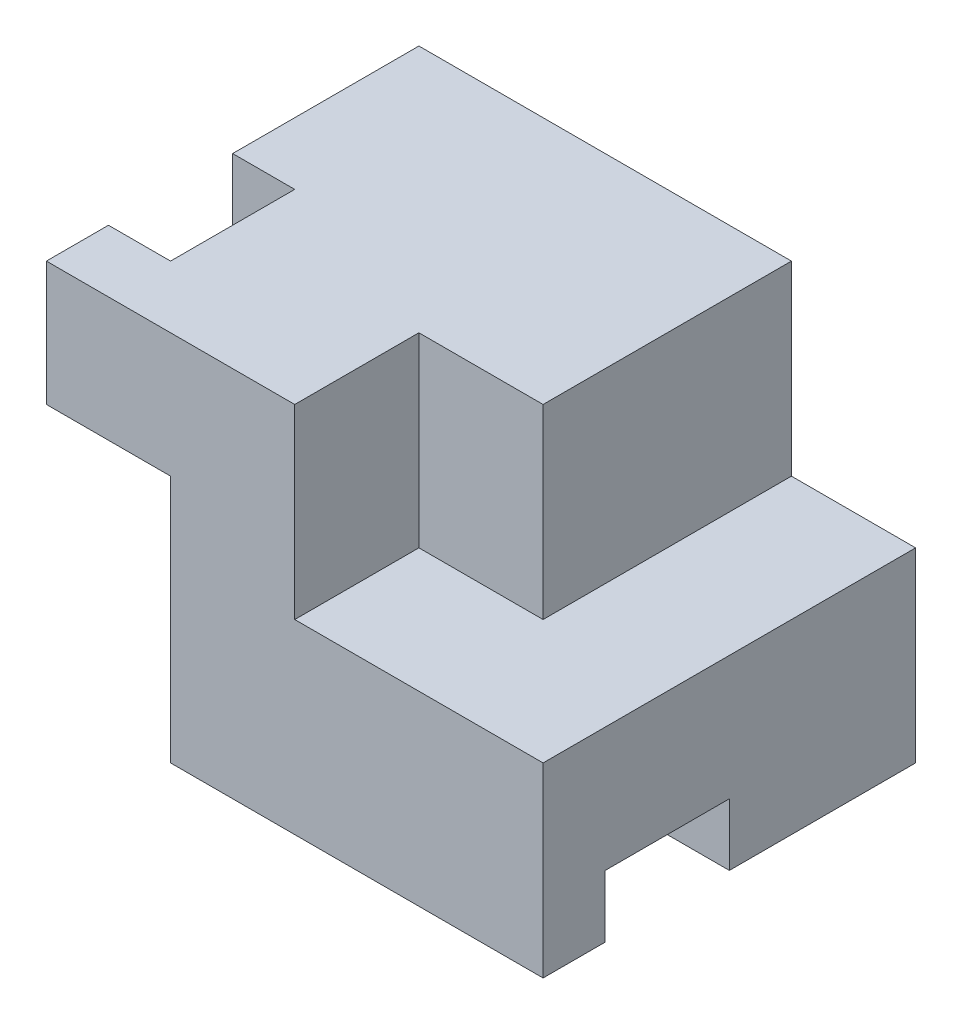
ISO-10303-21;
HEADER;
FILE_DESCRIPTION(('STEP AP214'),'2;1');
FILE_NAME('part.step','',(''),(''),'','','');
FILE_SCHEMA(('AUTOMOTIVE_DESIGN { 1 0 10303 214 1 1 1 1 }'));
ENDSEC;
DATA;
#1=APPLICATION_CONTEXT('core data for automotive mechanical design processes');
#2=APPLICATION_PROTOCOL_DEFINITION('international standard','automotive_design',2000,#1);
#3=PRODUCT_CONTEXT('',#1,'mechanical');
#4=PRODUCT('Part','Part','',(#3));
#5=PRODUCT_RELATED_PRODUCT_CATEGORY('part','',(#4));
#6=PRODUCT_DEFINITION_FORMATION('','',#4);
#7=PRODUCT_DEFINITION_CONTEXT('part definition',#1,'design');
#8=PRODUCT_DEFINITION('design','',#6,#7);
#9=PRODUCT_DEFINITION_SHAPE('','',#8);
#10=(LENGTH_UNIT() NAMED_UNIT(*) SI_UNIT(.MILLI.,.METRE.));
#11=(NAMED_UNIT(*) PLANE_ANGLE_UNIT() SI_UNIT($,.RADIAN.));
#12=(NAMED_UNIT(*) SI_UNIT($,.STERADIAN.) SOLID_ANGLE_UNIT());
#13=UNCERTAINTY_MEASURE_WITH_UNIT(LENGTH_MEASURE(1.E-05),#10,'distance_accuracy_value','');
#14=(GEOMETRIC_REPRESENTATION_CONTEXT(3) GLOBAL_UNCERTAINTY_ASSIGNED_CONTEXT((#13)) GLOBAL_UNIT_ASSIGNED_CONTEXT((#10,
#11,#12)) REPRESENTATION_CONTEXT('',''));
#15=CARTESIAN_POINT('',(0.,0.,0.));
#16=DIRECTION('',(0.,0.,1.));
#17=DIRECTION('',(1.,0.,0.));
#18=AXIS2_PLACEMENT_3D('',#15,#16,#17);
#19=CARTESIAN_POINT('',(203.2,0.,-152.4));
#20=DIRECTION('',(1.,0.,0.));
#21=DIRECTION('',(0.,0.,-1.));
#22=AXIS2_PLACEMENT_3D('',#19,#20,#21);
#23=PLANE('',#22);
#24=DIRECTION('',(0.,1.,0.));
#25=VECTOR('',#24,1.);
#26=CARTESIAN_POINT('',(203.2,0.,-152.4));
#27=LINE('',#26,#25);
#28=CARTESIAN_POINT('',(203.2,0.,-152.4));
#29=VERTEX_POINT('',#28);
#30=CARTESIAN_POINT('',(203.2,76.2,-152.4));
#31=VERTEX_POINT('',#30);
#32=EDGE_CURVE('E251',#29,#31,#27,.T.);
#33=ORIENTED_EDGE('',*,*,#32,.T.);
#34=DIRECTION('',(0.,0.,-1.));
#35=VECTOR('',#34,1.);
#36=CARTESIAN_POINT('',(203.2,76.2,0.));
#37=LINE('',#36,#35);
#38=CARTESIAN_POINT('',(203.2,76.2,0.));
#39=VERTEX_POINT('',#38);
#40=EDGE_CURVE('E167',#39,#31,#37,.T.);
#41=ORIENTED_EDGE('',*,*,#40,.F.);
#42=DIRECTION('',(0.,1.,0.));
#43=VECTOR('',#42,1.);
#44=CARTESIAN_POINT('',(203.2,0.,0.));
#45=LINE('',#44,#43);
#46=CARTESIAN_POINT('',(203.2,0.,0.));
#47=VERTEX_POINT('',#46);
#48=EDGE_CURVE('E260',#47,#39,#45,.T.);
#49=ORIENTED_EDGE('',*,*,#48,.F.);
#50=DIRECTION('',(0.,0.,1.));
#51=VECTOR('',#50,1.);
#52=CARTESIAN_POINT('',(203.2,0.,-152.4));
#53=LINE('',#52,#51);
#54=CARTESIAN_POINT('',(203.2,0.,-25.4));
#55=VERTEX_POINT('',#54);
#56=EDGE_CURVE('E269',#55,#47,#53,.T.);
#57=ORIENTED_EDGE('',*,*,#56,.F.);
#58=DIRECTION('',(0.,-1.,0.));
#59=VECTOR('',#58,1.);
#60=CARTESIAN_POINT('',(203.2,0.,-25.4));
#61=LINE('',#60,#59);
#62=CARTESIAN_POINT('',(203.2,25.4,-25.4));
#63=VERTEX_POINT('',#62);
#64=EDGE_CURVE('E190',#63,#55,#61,.T.);
#65=ORIENTED_EDGE('',*,*,#64,.F.);
#66=DIRECTION('',(0.,0.,1.));
#67=VECTOR('',#66,1.);
#68=CARTESIAN_POINT('',(203.2,25.4,-25.4));
#69=LINE('',#68,#67);
#70=CARTESIAN_POINT('',(203.2,25.4,-76.2));
#71=VERTEX_POINT('',#70);
#72=EDGE_CURVE('E187',#71,#63,#69,.T.);
#73=ORIENTED_EDGE('',*,*,#72,.F.);
#74=DIRECTION('',(0.,1.,0.));
#75=VECTOR('',#74,1.);
#76=CARTESIAN_POINT('',(203.2,0.,-76.2));
#77=LINE('',#76,#75);
#78=CARTESIAN_POINT('',(203.2,0.,-76.2));
#79=VERTEX_POINT('',#78);
#80=EDGE_CURVE('E192',#79,#71,#77,.T.);
#81=ORIENTED_EDGE('',*,*,#80,.F.);
#82=EDGE_CURVE('E267',#29,#79,#53,.T.);
#83=ORIENTED_EDGE('',*,*,#82,.F.);
#84=EDGE_LOOP('',(#33,#41,#49,#57,#65,#73,#81,#83));
#85=FACE_BOUND('',#84,.T.);
#86=ADVANCED_FACE('F33',(#85),#23,.T.);
#87=CARTESIAN_POINT('',(0.,0.,-152.4));
#88=DIRECTION('',(0.,-1.,0.));
#89=DIRECTION('',(0.,0.,-1.));
#90=AXIS2_PLACEMENT_3D('',#87,#88,#89);
#91=PLANE('',#90);
#92=DIRECTION('',(1.,0.,0.));
#93=VECTOR('',#92,1.);
#94=CARTESIAN_POINT('',(50.8,0.,-25.4));
#95=LINE('',#94,#93);
#96=CARTESIAN_POINT('',(50.8,0.,-25.4));
#97=VERTEX_POINT('',#96);
#98=EDGE_CURVE('E189',#97,#55,#95,.T.);
#99=ORIENTED_EDGE('',*,*,#98,.T.);
#100=ORIENTED_EDGE('',*,*,#56,.T.);
#101=DIRECTION('',(1.,0.,0.));
#102=VECTOR('',#101,1.);
#103=CARTESIAN_POINT('',(0.,0.,0.));
#104=LINE('',#103,#102);
#105=CARTESIAN_POINT('',(50.8,0.,0.));
#106=VERTEX_POINT('',#105);
#107=EDGE_CURVE('E257',#106,#47,#104,.T.);
#108=ORIENTED_EDGE('',*,*,#107,.F.);
#109=DIRECTION('',(0.,0.,1.));
#110=VECTOR('',#109,1.);
#111=CARTESIAN_POINT('',(50.8,0.,-76.2));
#112=LINE('',#111,#110);
#113=EDGE_CURVE('E233',#97,#106,#112,.T.);
#114=ORIENTED_EDGE('',*,*,#113,.F.);
#115=EDGE_LOOP('',(#99,#100,#108,#114));
#116=FACE_BOUND('',#115,.T.);
#117=ADVANCED_FACE('F275',(#116),#91,.T.);
#118=CARTESIAN_POINT('',(0.,0.,-152.4));
#119=DIRECTION('',(-1.,0.,0.));
#120=DIRECTION('',(0.,0.,1.));
#121=AXIS2_PLACEMENT_3D('',#118,#119,#120);
#122=PLANE('',#121);
#123=DIRECTION('',(0.,-1.,0.));
#124=VECTOR('',#123,1.);
#125=CARTESIAN_POINT('',(0.,0.,-76.2));
#126=LINE('',#125,#124);
#127=CARTESIAN_POINT('',(0.,152.4,-76.2));
#128=VERTEX_POINT('',#127);
#129=CARTESIAN_POINT('',(0.,0.,-76.2));
#130=VERTEX_POINT('',#129);
#131=EDGE_CURVE('E223',#128,#130,#126,.T.);
#132=ORIENTED_EDGE('',*,*,#131,.F.);
#133=DIRECTION('',(0.,0.,1.));
#134=VECTOR('',#133,1.);
#135=CARTESIAN_POINT('',(0.,152.4,-152.4));
#136=LINE('',#135,#134);
#137=CARTESIAN_POINT('',(0.,152.4,-152.4));
#138=VERTEX_POINT('',#137);
#139=EDGE_CURVE('E41',#138,#128,#136,.T.);
#140=ORIENTED_EDGE('',*,*,#139,.F.);
#141=DIRECTION('',(0.,-1.,0.));
#142=VECTOR('',#141,1.);
#143=CARTESIAN_POINT('',(0.,0.,-152.4));
#144=LINE('',#143,#142);
#145=CARTESIAN_POINT('',(0.,0.,-152.4));
#146=VERTEX_POINT('',#145);
#147=EDGE_CURVE('E244',#138,#146,#144,.T.);
#148=ORIENTED_EDGE('',*,*,#147,.T.);
#149=DIRECTION('',(0.,0.,1.));
#150=VECTOR('',#149,1.);
#151=CARTESIAN_POINT('',(0.,0.,-152.4));
#152=LINE('',#151,#150);
#153=EDGE_CURVE('E254',#146,#130,#152,.T.);
#154=ORIENTED_EDGE('',*,*,#153,.T.);
#155=EDGE_LOOP('',(#132,#140,#148,#154));
#156=FACE_BOUND('',#155,.T.);
#157=ADVANCED_FACE('F312',(#156),#122,.T.);
#158=DIRECTION('',(0.,1.,0.));
#159=VECTOR('',#158,1.);
#160=CARTESIAN_POINT('',(0.,76.2,-25.4));
#161=LINE('',#160,#159);
#162=CARTESIAN_POINT('',(0.,101.6,-25.4));
#163=VERTEX_POINT('',#162);
#164=CARTESIAN_POINT('',(0.,152.4,-25.4));
#165=VERTEX_POINT('',#164);
#166=EDGE_CURVE('E213',#163,#165,#161,.T.);
#167=ORIENTED_EDGE('',*,*,#166,.F.);
#168=DIRECTION('',(0.,0.,1.));
#169=VECTOR('',#168,1.);
#170=CARTESIAN_POINT('',(0.,101.6,-76.2));
#171=LINE('',#170,#169);
#172=CARTESIAN_POINT('',(0.,101.6,0.));
#173=VERTEX_POINT('',#172);
#174=EDGE_CURVE('E238',#163,#173,#171,.T.);
#175=ORIENTED_EDGE('',*,*,#174,.T.);
#176=DIRECTION('',(0.,-1.,0.));
#177=VECTOR('',#176,1.);
#178=CARTESIAN_POINT('',(0.,0.,0.));
#179=LINE('',#178,#177);
#180=CARTESIAN_POINT('',(0.,152.4,0.));
#181=VERTEX_POINT('',#180);
#182=EDGE_CURVE('E240',#181,#173,#179,.T.);
#183=ORIENTED_EDGE('',*,*,#182,.F.);
#184=EDGE_CURVE('E266',#165,#181,#136,.T.);
#185=ORIENTED_EDGE('',*,*,#184,.F.);
#186=EDGE_LOOP('',(#167,#175,#183,#185));
#187=FACE_BOUND('',#186,.T.);
#188=ADVANCED_FACE('F35',(#187),#122,.T.);
#189=CARTESIAN_POINT('',(0.,152.4,-152.4));
#190=DIRECTION('',(0.,1.,0.));
#191=DIRECTION('',(0.,0.,1.));
#192=AXIS2_PLACEMENT_3D('',#189,#190,#191);
#193=PLANE('',#192);
#194=DIRECTION('',(0.,0.,1.));
#195=VECTOR('',#194,1.);
#196=CARTESIAN_POINT('',(101.6,152.4,-50.8));
#197=LINE('',#196,#195);
#198=CARTESIAN_POINT('',(101.6,152.4,-50.8));
#199=VERTEX_POINT('',#198);
#200=CARTESIAN_POINT('',(101.6,152.4,0.));
#201=VERTEX_POINT('',#200);
#202=EDGE_CURVE('E171',#199,#201,#197,.T.);
#203=ORIENTED_EDGE('',*,*,#202,.F.);
#204=DIRECTION('',(-1.,0.,0.));
#205=VECTOR('',#204,1.);
#206=CARTESIAN_POINT('',(152.4,152.4,-50.8));
#207=LINE('',#206,#205);
#208=CARTESIAN_POINT('',(152.4,152.4,-50.8));
#209=VERTEX_POINT('',#208);
#210=EDGE_CURVE('E470',#209,#199,#207,.T.);
#211=ORIENTED_EDGE('',*,*,#210,.F.);
#212=DIRECTION('',(0.,0.,1.));
#213=VECTOR('',#212,1.);
#214=CARTESIAN_POINT('',(152.4,152.4,-152.4));
#215=LINE('',#214,#213);
#216=CARTESIAN_POINT('',(152.4,152.4,-152.4));
#217=VERTEX_POINT('',#216);
#218=EDGE_CURVE('E471',#217,#209,#215,.T.);
#219=ORIENTED_EDGE('',*,*,#218,.F.);
#220=DIRECTION('',(-1.,0.,0.));
#221=VECTOR('',#220,1.);
#222=CARTESIAN_POINT('',(0.,152.4,-152.4));
#223=LINE('',#222,#221);
#224=EDGE_CURVE('E176',#217,#138,#223,.T.);
#225=ORIENTED_EDGE('',*,*,#224,.T.);
#226=ORIENTED_EDGE('',*,*,#139,.T.);
#227=DIRECTION('',(-1.,0.,0.));
#228=VECTOR('',#227,1.);
#229=CARTESIAN_POINT('',(0.,152.4,-76.2));
#230=LINE('',#229,#228);
#231=CARTESIAN_POINT('',(25.4,152.4,-76.2));
#232=VERTEX_POINT('',#231);
#233=EDGE_CURVE('E210',#232,#128,#230,.T.);
#234=ORIENTED_EDGE('',*,*,#233,.F.);
#235=DIRECTION('',(0.,0.,-1.));
#236=VECTOR('',#235,1.);
#237=CARTESIAN_POINT('',(25.4,152.4,-25.4));
#238=LINE('',#237,#236);
#239=CARTESIAN_POINT('',(25.4,152.4,-25.4));
#240=VERTEX_POINT('',#239);
#241=EDGE_CURVE('E207',#240,#232,#238,.T.);
#242=ORIENTED_EDGE('',*,*,#241,.F.);
#243=DIRECTION('',(1.,0.,0.));
#244=VECTOR('',#243,1.);
#245=CARTESIAN_POINT('',(0.,152.4,-25.4));
#246=LINE('',#245,#244);
#247=EDGE_CURVE('E200',#165,#240,#246,.T.);
#248=ORIENTED_EDGE('',*,*,#247,.F.);
#249=ORIENTED_EDGE('',*,*,#184,.T.);
#250=DIRECTION('',(-1.,0.,0.));
#251=VECTOR('',#250,1.);
#252=CARTESIAN_POINT('',(0.,152.4,0.));
#253=LINE('',#252,#251);
#254=EDGE_CURVE('E248',#201,#181,#253,.T.);
#255=ORIENTED_EDGE('',*,*,#254,.F.);
#256=EDGE_LOOP('',(#203,#211,#219,#225,#226,#234,#242,#248,#249,#255));
#257=FACE_BOUND('',#256,.T.);
#258=ADVANCED_FACE('F310',(#257),#193,.T.);
#259=ORIENTED_EDGE('',*,*,#82,.T.);
#260=DIRECTION('',(1.,0.,0.));
#261=VECTOR('',#260,1.);
#262=CARTESIAN_POINT('',(0.,0.,-76.2));
#263=LINE('',#262,#261);
#264=EDGE_CURVE('E225',#130,#79,#263,.T.);
#265=ORIENTED_EDGE('',*,*,#264,.F.);
#266=ORIENTED_EDGE('',*,*,#153,.F.);
#267=DIRECTION('',(1.,0.,0.));
#268=VECTOR('',#267,1.);
#269=CARTESIAN_POINT('',(0.,0.,-152.4));
#270=LINE('',#269,#268);
#271=EDGE_CURVE('E247',#146,#29,#270,.T.);
#272=ORIENTED_EDGE('',*,*,#271,.T.);
#273=EDGE_LOOP('',(#259,#265,#266,#272));
#274=FACE_BOUND('',#273,.T.);
#275=ADVANCED_FACE('F288',(#274),#91,.T.);
#276=CARTESIAN_POINT('',(0.,0.,-152.4));
#277=DIRECTION('',(0.,0.,-1.));
#278=DIRECTION('',(-1.,0.,0.));
#279=AXIS2_PLACEMENT_3D('',#276,#277,#278);
#280=PLANE('',#279);
#281=DIRECTION('',(0.,1.,0.));
#282=VECTOR('',#281,1.);
#283=CARTESIAN_POINT('',(152.4,76.2,-152.4));
#284=LINE('',#283,#282);
#285=CARTESIAN_POINT('',(152.4,76.2,-152.4));
#286=VERTEX_POINT('',#285);
#287=EDGE_CURVE('E157',#286,#217,#284,.T.);
#288=ORIENTED_EDGE('',*,*,#287,.F.);
#289=DIRECTION('',(-1.,0.,0.));
#290=VECTOR('',#289,1.);
#291=CARTESIAN_POINT('',(203.2,76.2,-152.4));
#292=LINE('',#291,#290);
#293=EDGE_CURVE('E162',#31,#286,#292,.T.);
#294=ORIENTED_EDGE('',*,*,#293,.F.);
#295=ORIENTED_EDGE('',*,*,#32,.F.);
#296=ORIENTED_EDGE('',*,*,#271,.F.);
#297=ORIENTED_EDGE('',*,*,#147,.F.);
#298=ORIENTED_EDGE('',*,*,#224,.F.);
#299=EDGE_LOOP('',(#288,#294,#295,#296,#297,#298));
#300=FACE_BOUND('',#299,.T.);
#301=ADVANCED_FACE('F174',(#300),#280,.T.);
#302=CARTESIAN_POINT('',(0.,0.,0.));
#303=DIRECTION('',(0.,0.,-1.));
#304=DIRECTION('',(-1.,0.,0.));
#305=AXIS2_PLACEMENT_3D('',#302,#303,#304);
#306=PLANE('',#305);
#307=DIRECTION('',(1.,0.,0.));
#308=VECTOR('',#307,1.);
#309=CARTESIAN_POINT('',(101.6,76.2,0.));
#310=LINE('',#309,#308);
#311=CARTESIAN_POINT('',(101.6,76.2,0.));
#312=VERTEX_POINT('',#311);
#313=EDGE_CURVE('E180',#312,#39,#310,.T.);
#314=ORIENTED_EDGE('',*,*,#313,.F.);
#315=DIRECTION('',(0.,1.,0.));
#316=VECTOR('',#315,1.);
#317=CARTESIAN_POINT('',(101.6,76.2,0.));
#318=LINE('',#317,#316);
#319=EDGE_CURVE('E193',#312,#201,#318,.T.);
#320=ORIENTED_EDGE('',*,*,#319,.T.);
#321=ORIENTED_EDGE('',*,*,#254,.T.);
#322=ORIENTED_EDGE('',*,*,#182,.T.);
#323=DIRECTION('',(-1.,0.,0.));
#324=VECTOR('',#323,1.);
#325=CARTESIAN_POINT('',(0.,101.6,0.));
#326=LINE('',#325,#324);
#327=CARTESIAN_POINT('',(50.8,101.6,0.));
#328=VERTEX_POINT('',#327);
#329=EDGE_CURVE('E226',#328,#173,#326,.T.);
#330=ORIENTED_EDGE('',*,*,#329,.F.);
#331=DIRECTION('',(0.,1.,0.));
#332=VECTOR('',#331,1.);
#333=CARTESIAN_POINT('',(50.8,0.,0.));
#334=LINE('',#333,#332);
#335=EDGE_CURVE('E222',#106,#328,#334,.T.);
#336=ORIENTED_EDGE('',*,*,#335,.F.);
#337=ORIENTED_EDGE('',*,*,#107,.T.);
#338=ORIENTED_EDGE('',*,*,#48,.T.);
#339=EDGE_LOOP('',(#314,#320,#321,#322,#330,#336,#337,#338));
#340=FACE_BOUND('',#339,.T.);
#341=ADVANCED_FACE('F283',(#340),#306,.F.);
#342=CARTESIAN_POINT('',(0.,101.6,-76.2));
#343=DIRECTION('',(0.,1.,0.));
#344=DIRECTION('',(0.,0.,1.));
#345=AXIS2_PLACEMENT_3D('',#342,#343,#344);
#346=PLANE('',#345);
#347=DIRECTION('',(1.,0.,0.));
#348=VECTOR('',#347,1.);
#349=CARTESIAN_POINT('',(0.,101.6,-25.4));
#350=LINE('',#349,#348);
#351=CARTESIAN_POINT('',(25.4,101.6,-25.4));
#352=VERTEX_POINT('',#351);
#353=EDGE_CURVE('E11',#163,#352,#350,.T.);
#354=ORIENTED_EDGE('',*,*,#353,.T.);
#355=DIRECTION('',(0.,0.,-1.));
#356=VECTOR('',#355,1.);
#357=CARTESIAN_POINT('',(25.4,101.6,-76.2));
#358=LINE('',#357,#356);
#359=CARTESIAN_POINT('',(25.4,101.6,-76.2));
#360=VERTEX_POINT('',#359);
#361=EDGE_CURVE('E216',#352,#360,#358,.T.);
#362=ORIENTED_EDGE('',*,*,#361,.T.);
#363=DIRECTION('',(-1.,0.,0.));
#364=VECTOR('',#363,1.);
#365=CARTESIAN_POINT('',(0.,101.6,-76.2));
#366=LINE('',#365,#364);
#367=CARTESIAN_POINT('',(50.8,101.6,-76.2));
#368=VERTEX_POINT('',#367);
#369=EDGE_CURVE('E230',#368,#360,#366,.T.);
#370=ORIENTED_EDGE('',*,*,#369,.F.);
#371=DIRECTION('',(0.,0.,1.));
#372=VECTOR('',#371,1.);
#373=CARTESIAN_POINT('',(50.8,101.6,-76.2));
#374=LINE('',#373,#372);
#375=EDGE_CURVE('E241',#368,#328,#374,.T.);
#376=ORIENTED_EDGE('',*,*,#375,.T.);
#377=ORIENTED_EDGE('',*,*,#329,.T.);
#378=ORIENTED_EDGE('',*,*,#174,.F.);
#379=EDGE_LOOP('',(#354,#362,#370,#376,#377,#378));
#380=FACE_BOUND('',#379,.T.);
#381=ADVANCED_FACE('F301',(#380),#346,.F.);
#382=CARTESIAN_POINT('',(50.8,0.,-76.2));
#383=DIRECTION('',(1.,0.,0.));
#384=DIRECTION('',(0.,1.,0.));
#385=AXIS2_PLACEMENT_3D('',#382,#383,#384);
#386=PLANE('',#385);
#387=DIRECTION('',(0.,0.,1.));
#388=VECTOR('',#387,1.);
#389=CARTESIAN_POINT('',(50.8,25.4,-25.4));
#390=LINE('',#389,#388);
#391=CARTESIAN_POINT('',(50.8,25.4,-76.2));
#392=VERTEX_POINT('',#391);
#393=CARTESIAN_POINT('',(50.8,25.4,-25.4));
#394=VERTEX_POINT('',#393);
#395=EDGE_CURVE('E56',#392,#394,#390,.T.);
#396=ORIENTED_EDGE('',*,*,#395,.T.);
#397=DIRECTION('',(0.,-1.,0.));
#398=VECTOR('',#397,1.);
#399=CARTESIAN_POINT('',(50.8,0.,-25.4));
#400=LINE('',#399,#398);
#401=EDGE_CURVE('E184',#394,#97,#400,.T.);
#402=ORIENTED_EDGE('',*,*,#401,.T.);
#403=ORIENTED_EDGE('',*,*,#113,.T.);
#404=ORIENTED_EDGE('',*,*,#335,.T.);
#405=ORIENTED_EDGE('',*,*,#375,.F.);
#406=DIRECTION('',(0.,1.,0.));
#407=VECTOR('',#406,1.);
#408=CARTESIAN_POINT('',(50.8,0.,-76.2));
#409=LINE('',#408,#407);
#410=EDGE_CURVE('E228',#392,#368,#409,.T.);
#411=ORIENTED_EDGE('',*,*,#410,.F.);
#412=EDGE_LOOP('',(#396,#402,#403,#404,#405,#411));
#413=FACE_BOUND('',#412,.T.);
#414=ADVANCED_FACE('F298',(#413),#386,.F.);
#415=CARTESIAN_POINT('',(0.,0.,-76.2));
#416=DIRECTION('',(0.,0.,-1.));
#417=DIRECTION('',(-1.,0.,0.));
#418=AXIS2_PLACEMENT_3D('',#415,#416,#417);
#419=PLANE('',#418);
#420=ORIENTED_EDGE('',*,*,#369,.T.);
#421=DIRECTION('',(0.,1.,0.));
#422=VECTOR('',#421,1.);
#423=CARTESIAN_POINT('',(25.4,76.2,-76.2));
#424=LINE('',#423,#422);
#425=EDGE_CURVE('E214',#360,#232,#424,.T.);
#426=ORIENTED_EDGE('',*,*,#425,.T.);
#427=ORIENTED_EDGE('',*,*,#233,.T.);
#428=ORIENTED_EDGE('',*,*,#131,.T.);
#429=ORIENTED_EDGE('',*,*,#264,.T.);
#430=ORIENTED_EDGE('',*,*,#80,.T.);
#431=DIRECTION('',(1.,0.,0.));
#432=VECTOR('',#431,1.);
#433=CARTESIAN_POINT('',(50.8,25.4,-76.2));
#434=LINE('',#433,#432);
#435=EDGE_CURVE('E201',#392,#71,#434,.T.);
#436=ORIENTED_EDGE('',*,*,#435,.F.);
#437=ORIENTED_EDGE('',*,*,#410,.T.);
#438=EDGE_LOOP('',(#420,#426,#427,#428,#429,#430,#436,#437));
#439=FACE_BOUND('',#438,.T.);
#440=ADVANCED_FACE('F291',(#439),#419,.F.);
#441=CARTESIAN_POINT('',(0.,76.2,-25.4));
#442=DIRECTION('',(0.,0.,1.));
#443=DIRECTION('',(1.,0.,0.));
#444=AXIS2_PLACEMENT_3D('',#441,#442,#443);
#445=PLANE('',#444);
#446=ORIENTED_EDGE('',*,*,#166,.T.);
#447=ORIENTED_EDGE('',*,*,#247,.T.);
#448=DIRECTION('',(0.,1.,0.));
#449=VECTOR('',#448,1.);
#450=CARTESIAN_POINT('',(25.4,76.2,-25.4));
#451=LINE('',#450,#449);
#452=EDGE_CURVE('E217',#352,#240,#451,.T.);
#453=ORIENTED_EDGE('',*,*,#452,.F.);
#454=ORIENTED_EDGE('',*,*,#353,.F.);
#455=EDGE_LOOP('',(#446,#447,#453,#454));
#456=FACE_BOUND('',#455,.T.);
#457=ADVANCED_FACE('F357',(#456),#445,.F.);
#458=CARTESIAN_POINT('',(25.4,76.2,-25.4));
#459=DIRECTION('',(1.,0.,0.));
#460=DIRECTION('',(0.,0.,-1.));
#461=AXIS2_PLACEMENT_3D('',#458,#459,#460);
#462=PLANE('',#461);
#463=ORIENTED_EDGE('',*,*,#452,.T.);
#464=ORIENTED_EDGE('',*,*,#241,.T.);
#465=ORIENTED_EDGE('',*,*,#425,.F.);
#466=ORIENTED_EDGE('',*,*,#361,.F.);
#467=EDGE_LOOP('',(#463,#464,#465,#466));
#468=FACE_BOUND('',#467,.T.);
#469=ADVANCED_FACE('F306',(#468),#462,.F.);
#470=CARTESIAN_POINT('',(50.8,0.,-25.4));
#471=DIRECTION('',(0.,0.,1.));
#472=DIRECTION('',(0.,-1.,0.));
#473=AXIS2_PLACEMENT_3D('',#470,#471,#472);
#474=PLANE('',#473);
#475=ORIENTED_EDGE('',*,*,#64,.T.);
#476=ORIENTED_EDGE('',*,*,#98,.F.);
#477=ORIENTED_EDGE('',*,*,#401,.F.);
#478=DIRECTION('',(1.,0.,0.));
#479=VECTOR('',#478,1.);
#480=CARTESIAN_POINT('',(50.8,25.4,-25.4));
#481=LINE('',#480,#479);
#482=EDGE_CURVE('E198',#394,#63,#481,.T.);
#483=ORIENTED_EDGE('',*,*,#482,.T.);
#484=EDGE_LOOP('',(#475,#476,#477,#483));
#485=FACE_BOUND('',#484,.T.);
#486=ADVANCED_FACE('F373',(#485),#474,.F.);
#487=CARTESIAN_POINT('',(50.8,25.4,-25.4));
#488=DIRECTION('',(0.,1.,0.));
#489=DIRECTION('',(0.,0.,1.));
#490=AXIS2_PLACEMENT_3D('',#487,#488,#489);
#491=PLANE('',#490);
#492=ORIENTED_EDGE('',*,*,#72,.T.);
#493=ORIENTED_EDGE('',*,*,#482,.F.);
#494=ORIENTED_EDGE('',*,*,#395,.F.);
#495=ORIENTED_EDGE('',*,*,#435,.T.);
#496=EDGE_LOOP('',(#492,#493,#494,#495));
#497=FACE_BOUND('',#496,.T.);
#498=ADVANCED_FACE('F293',(#497),#491,.F.);
#499=CARTESIAN_POINT('',(101.6,76.2,-50.8));
#500=DIRECTION('',(-1.,0.,0.));
#501=DIRECTION('',(0.,0.,1.));
#502=AXIS2_PLACEMENT_3D('',#499,#500,#501);
#503=PLANE('',#502);
#504=ORIENTED_EDGE('',*,*,#202,.T.);
#505=ORIENTED_EDGE('',*,*,#319,.F.);
#506=DIRECTION('',(0.,0.,1.));
#507=VECTOR('',#506,1.);
#508=CARTESIAN_POINT('',(101.6,76.2,-50.8));
#509=LINE('',#508,#507);
#510=CARTESIAN_POINT('',(101.6,76.2,-50.8));
#511=VERTEX_POINT('',#510);
#512=EDGE_CURVE('E48',#511,#312,#509,.T.);
#513=ORIENTED_EDGE('',*,*,#512,.F.);
#514=DIRECTION('',(0.,1.,0.));
#515=VECTOR('',#514,1.);
#516=CARTESIAN_POINT('',(101.6,76.2,-50.8));
#517=LINE('',#516,#515);
#518=EDGE_CURVE('E178',#511,#199,#517,.T.);
#519=ORIENTED_EDGE('',*,*,#518,.T.);
#520=EDGE_LOOP('',(#504,#505,#513,#519));
#521=FACE_BOUND('',#520,.T.);
#522=ADVANCED_FACE('F415',(#521),#503,.F.);
#523=CARTESIAN_POINT('',(152.4,76.2,-50.8));
#524=DIRECTION('',(0.,0.,-1.));
#525=DIRECTION('',(-1.,0.,0.));
#526=AXIS2_PLACEMENT_3D('',#523,#524,#525);
#527=PLANE('',#526);
#528=ORIENTED_EDGE('',*,*,#210,.T.);
#529=ORIENTED_EDGE('',*,*,#518,.F.);
#530=DIRECTION('',(-1.,0.,0.));
#531=VECTOR('',#530,1.);
#532=CARTESIAN_POINT('',(152.4,76.2,-50.8));
#533=LINE('',#532,#531);
#534=CARTESIAN_POINT('',(152.4,76.2,-50.8));
#535=VERTEX_POINT('',#534);
#536=EDGE_CURVE('E161',#535,#511,#533,.T.);
#537=ORIENTED_EDGE('',*,*,#536,.F.);
#538=DIRECTION('',(0.,1.,0.));
#539=VECTOR('',#538,1.);
#540=CARTESIAN_POINT('',(152.4,76.2,-50.8));
#541=LINE('',#540,#539);
#542=EDGE_CURVE('E159',#535,#209,#541,.T.);
#543=ORIENTED_EDGE('',*,*,#542,.T.);
#544=EDGE_LOOP('',(#528,#529,#537,#543));
#545=FACE_BOUND('',#544,.T.);
#546=ADVANCED_FACE('F430',(#545),#527,.F.);
#547=CARTESIAN_POINT('',(152.4,76.2,-152.4));
#548=DIRECTION('',(-1.,0.,0.));
#549=DIRECTION('',(0.,0.,1.));
#550=AXIS2_PLACEMENT_3D('',#547,#548,#549);
#551=PLANE('',#550);
#552=ORIENTED_EDGE('',*,*,#218,.T.);
#553=ORIENTED_EDGE('',*,*,#542,.F.);
#554=DIRECTION('',(0.,0.,1.));
#555=VECTOR('',#554,1.);
#556=CARTESIAN_POINT('',(152.4,76.2,-152.4));
#557=LINE('',#556,#555);
#558=EDGE_CURVE('E152',#286,#535,#557,.T.);
#559=ORIENTED_EDGE('',*,*,#558,.F.);
#560=ORIENTED_EDGE('',*,*,#287,.T.);
#561=EDGE_LOOP('',(#552,#553,#559,#560));
#562=FACE_BOUND('',#561,.T.);
#563=ADVANCED_FACE('F155',(#562),#551,.F.);
#564=CARTESIAN_POINT('',(0.,76.2,0.));
#565=DIRECTION('',(0.,1.,0.));
#566=DIRECTION('',(0.,0.,1.));
#567=AXIS2_PLACEMENT_3D('',#564,#565,#566);
#568=PLANE('',#567);
#569=ORIENTED_EDGE('',*,*,#293,.T.);
#570=ORIENTED_EDGE('',*,*,#558,.T.);
#571=ORIENTED_EDGE('',*,*,#536,.T.);
#572=ORIENTED_EDGE('',*,*,#512,.T.);
#573=ORIENTED_EDGE('',*,*,#313,.T.);
#574=ORIENTED_EDGE('',*,*,#40,.T.);
#575=EDGE_LOOP('',(#569,#570,#571,#572,#573,#574));
#576=FACE_BOUND('',#575,.T.);
#577=ADVANCED_FACE('F165',(#576),#568,.T.);
#578=CLOSED_SHELL('',(#86,#117,#157,#188,#258,#275,#301,#341,#381,#414,#440,#457,#469,#486,#498,
#522,#546,#563,#577));
#579=MANIFOLD_SOLID_BREP('B2',#578);
#580=ADVANCED_BREP_SHAPE_REPRESENTATION('',(#18,#579),#14);
#581=SHAPE_DEFINITION_REPRESENTATION(#9,#580);
ENDSEC;
END-ISO-10303-21;
